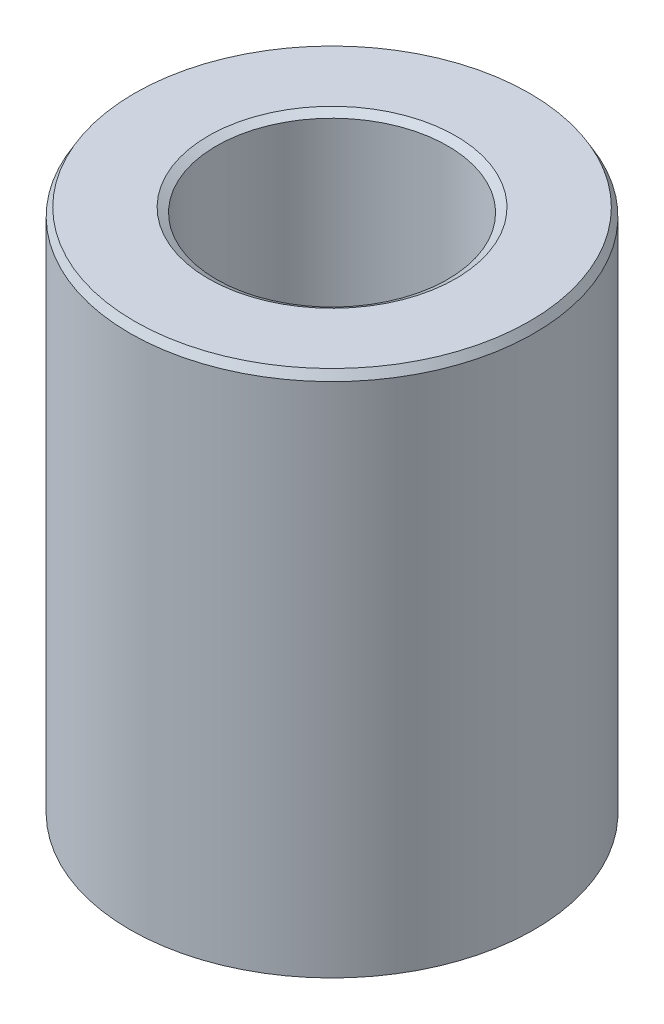
ISO-10303-21;
HEADER;
FILE_DESCRIPTION(('STEP AP214'),'2;1');
FILE_NAME('part.step','',(''),(''),'','','');
FILE_SCHEMA(('AUTOMOTIVE_DESIGN { 1 0 10303 214 1 1 1 1 }'));
ENDSEC;
DATA;
#1=APPLICATION_CONTEXT('core data for automotive mechanical design processes');
#2=APPLICATION_PROTOCOL_DEFINITION('international standard','automotive_design',2000,#1);
#3=PRODUCT_CONTEXT('',#1,'mechanical');
#4=PRODUCT('Part','Part','',(#3));
#5=PRODUCT_RELATED_PRODUCT_CATEGORY('part','',(#4));
#6=PRODUCT_DEFINITION_FORMATION('','',#4);
#7=PRODUCT_DEFINITION_CONTEXT('part definition',#1,'design');
#8=PRODUCT_DEFINITION('design','',#6,#7);
#9=PRODUCT_DEFINITION_SHAPE('','',#8);
#10=(LENGTH_UNIT() NAMED_UNIT(*) SI_UNIT(.MILLI.,.METRE.));
#11=(NAMED_UNIT(*) PLANE_ANGLE_UNIT() SI_UNIT($,.RADIAN.));
#12=(NAMED_UNIT(*) SI_UNIT($,.STERADIAN.) SOLID_ANGLE_UNIT());
#13=UNCERTAINTY_MEASURE_WITH_UNIT(LENGTH_MEASURE(1.E-05),#10,'distance_accuracy_value','');
#14=(GEOMETRIC_REPRESENTATION_CONTEXT(3) GLOBAL_UNCERTAINTY_ASSIGNED_CONTEXT((#13)) GLOBAL_UNIT_ASSIGNED_CONTEXT((#10,
#11,#12)) REPRESENTATION_CONTEXT('',''));
#15=CARTESIAN_POINT('',(0.,0.,0.));
#16=DIRECTION('',(0.,0.,1.));
#17=DIRECTION('',(1.,0.,0.));
#18=AXIS2_PLACEMENT_3D('',#15,#16,#17);
#19=CARTESIAN_POINT('',(0.,91.614825625066,0.));
#20=DIRECTION('',(0.,-1.,0.));
#21=DIRECTION('',(0.,0.,-1.));
#22=AXIS2_PLACEMENT_3D('',#19,#20,#21);
#23=CYLINDRICAL_SURFACE('',#22,35.);
#24=CARTESIAN_POINT('',(0.,0.805560483564102,0.));
#25=DIRECTION('',(0.,1.,0.));
#26=DIRECTION('',(0.,0.,1.));
#27=AXIS2_PLACEMENT_3D('',#24,#25,#26);
#28=CIRCLE('',#27,35.);
#29=CARTESIAN_POINT('',(0.,0.805560483564102,35.));
#30=VERTEX_POINT('',#29);
#31=EDGE_CURVE('E10',#30,#30,#28,.T.);
#32=ORIENTED_EDGE('',*,*,#31,.T.);
#33=EDGE_LOOP('',(#32));
#34=FACE_BOUND('',#33,.T.);
#35=CARTESIAN_POINT('',(0.,90.2195539389632,0.));
#36=DIRECTION('',(0.,1.,0.));
#37=DIRECTION('',(0.,0.,1.));
#38=AXIS2_PLACEMENT_3D('',#35,#36,#37);
#39=CIRCLE('',#38,35.);
#40=CARTESIAN_POINT('',(0.,90.2195539389632,35.));
#41=VERTEX_POINT('',#40);
#42=EDGE_CURVE('E50',#41,#41,#39,.F.);
#43=ORIENTED_EDGE('',*,*,#42,.T.);
#44=EDGE_LOOP('',(#43));
#45=FACE_BOUND('',#44,.T.);
#46=ADVANCED_FACE('F39',(#34,#45),#23,.T.);
#47=CARTESIAN_POINT('',(0.,91.614825625066,0.));
#48=DIRECTION('',(0.,1.,0.));
#49=DIRECTION('',(0.,0.,1.));
#50=AXIS2_PLACEMENT_3D('',#47,#48,#49);
#51=PLANE('',#50);
#52=CARTESIAN_POINT('',(0.,91.614825625066,0.));
#53=DIRECTION('',(0.,1.,0.));
#54=DIRECTION('',(0.,0.,1.));
#55=AXIS2_PLACEMENT_3D('',#52,#53,#54);
#56=CIRCLE('',#55,21.4186593110688);
#57=CARTESIAN_POINT('',(0.,91.614825625066,21.4186593110688));
#58=VERTEX_POINT('',#57);
#59=EDGE_CURVE('E58',#58,#58,#56,.F.);
#60=ORIENTED_EDGE('',*,*,#59,.T.);
#61=EDGE_LOOP('',(#60));
#62=FACE_BOUND('',#61,.T.);
#63=CARTESIAN_POINT('',(0.,91.614825625066,0.));
#64=DIRECTION('',(0.,1.,0.));
#65=DIRECTION('',(0.,0.,1.));
#66=AXIS2_PLACEMENT_3D('',#63,#64,#65);
#67=CIRCLE('',#66,34.1944395164359);
#68=CARTESIAN_POINT('',(0.,91.614825625066,34.1944395164359));
#69=VERTEX_POINT('',#68);
#70=EDGE_CURVE('E61',#69,#69,#67,.T.);
#71=ORIENTED_EDGE('',*,*,#70,.T.);
#72=EDGE_LOOP('',(#71));
#73=FACE_BOUND('',#72,.T.);
#74=ADVANCED_FACE('F88',(#62,#73),#51,.T.);
#75=CARTESIAN_POINT('',(0.,0.,0.));
#76=DIRECTION('',(0.,1.,0.));
#77=DIRECTION('',(0.,0.,1.));
#78=AXIS2_PLACEMENT_3D('',#75,#76,#77);
#79=PLANE('',#78);
#80=CARTESIAN_POINT('',(0.,0.,0.));
#81=DIRECTION('',(0.,1.,0.));
#82=DIRECTION('',(0.,0.,1.));
#83=AXIS2_PLACEMENT_3D('',#80,#81,#82);
#84=CIRCLE('',#83,20.8289481085301);
#85=CARTESIAN_POINT('',(0.,0.,20.8289481085301));
#86=VERTEX_POINT('',#85);
#87=EDGE_CURVE('E51',#86,#86,#84,.T.);
#88=ORIENTED_EDGE('',*,*,#87,.T.);
#89=EDGE_LOOP('',(#88));
#90=FACE_BOUND('',#89,.T.);
#91=CARTESIAN_POINT('',(0.,0.,0.));
#92=DIRECTION('',(0.,1.,0.));
#93=DIRECTION('',(0.,0.,1.));
#94=AXIS2_PLACEMENT_3D('',#91,#92,#93);
#95=CIRCLE('',#94,33.6047283138972);
#96=CARTESIAN_POINT('',(0.,0.,33.6047283138972));
#97=VERTEX_POINT('',#96);
#98=EDGE_CURVE('E54',#97,#97,#95,.F.);
#99=ORIENTED_EDGE('',*,*,#98,.T.);
#100=EDGE_LOOP('',(#99));
#101=FACE_BOUND('',#100,.T.);
#102=ADVANCED_FACE('F83',(#90,#101),#79,.F.);
#103=CARTESIAN_POINT('',(0.,91.614825625066,0.));
#104=DIRECTION('',(0.,-1.,0.));
#105=DIRECTION('',(0.,0.,-1.));
#106=AXIS2_PLACEMENT_3D('',#103,#104,#105);
#107=CYLINDRICAL_SURFACE('',#106,20.023387624966);
#108=CARTESIAN_POINT('',(0.,90.8092651415019,0.));
#109=DIRECTION('',(0.,1.,0.));
#110=DIRECTION('',(0.,0.,1.));
#111=AXIS2_PLACEMENT_3D('',#108,#109,#110);
#112=CIRCLE('',#111,20.023387624966);
#113=CARTESIAN_POINT('',(0.,90.8092651415019,20.023387624966));
#114=VERTEX_POINT('',#113);
#115=EDGE_CURVE('E67',#114,#114,#112,.T.);
#116=ORIENTED_EDGE('',*,*,#115,.T.);
#117=EDGE_LOOP('',(#116));
#118=FACE_BOUND('',#117,.T.);
#119=CARTESIAN_POINT('',(0.,1.39527168610276,0.));
#120=DIRECTION('',(0.,1.,0.));
#121=DIRECTION('',(0.,0.,1.));
#122=AXIS2_PLACEMENT_3D('',#119,#120,#121);
#123=CIRCLE('',#122,20.023387624966);
#124=CARTESIAN_POINT('',(0.,1.39527168610276,20.023387624966));
#125=VERTEX_POINT('',#124);
#126=EDGE_CURVE('E69',#125,#125,#123,.F.);
#127=ORIENTED_EDGE('',*,*,#126,.T.);
#128=EDGE_LOOP('',(#127));
#129=FACE_BOUND('',#128,.T.);
#130=ADVANCED_FACE('F71',(#118,#129),#107,.F.);
#131=CARTESIAN_POINT('',(0.,90.8092651415019,0.));
#132=DIRECTION('',(0.,1.,0.));
#133=DIRECTION('',(0.,0.,1.));
#134=AXIS2_PLACEMENT_3D('',#131,#132,#133);
#135=CONICAL_SURFACE('',#134,20.023387624966,1.0471975511966);
#136=CARTESIAN_POINT('',(0.,91.614825625066,21.4186593110688));
#137=CARTESIAN_POINT('',(0.,91.6064343700289,21.4041252310052));
#138=CARTESIAN_POINT('',(0.,91.5980431149917,21.3895911509416));
#139=CARTESIAN_POINT('',(0.,91.5812606049175,21.3605229908145));
#140=CARTESIAN_POINT('',(0.,91.5728693498803,21.3459889107509));
#141=CARTESIAN_POINT('',(0.,91.5560868398061,21.3169207506238));
#142=CARTESIAN_POINT('',(0.,91.547695584769,21.3023866705602));
#143=CARTESIAN_POINT('',(0.,91.5309130746947,21.2733185104331));
#144=CARTESIAN_POINT('',(0.,91.5225218196576,21.2587844303695));
#145=CARTESIAN_POINT('',(0.,91.5057393095833,21.2297162702423));
#146=CARTESIAN_POINT('',(0.,91.4973480545462,21.2151821901788));
#147=CARTESIAN_POINT('',(0.,91.480565544472,21.1861140300516));
#148=CARTESIAN_POINT('',(0.,91.4721742894348,21.1715799499881));
#149=CARTESIAN_POINT('',(0.,91.4553917793606,21.1425117898609));
#150=CARTESIAN_POINT('',(0.,91.4470005243235,21.1279777097973));
#151=CARTESIAN_POINT('',(0.,91.4302180142492,21.0989095496702));
#152=CARTESIAN_POINT('',(0.,91.4218267592121,21.0843754696066));
#153=CARTESIAN_POINT('',(0.,91.4050442491378,21.0553073094795));
#154=CARTESIAN_POINT('',(0.,91.3966529941007,21.0407732294159));
#155=CARTESIAN_POINT('',(0.,91.3798704840264,21.0117050692888));
#156=CARTESIAN_POINT('',(0.,91.3714792289893,20.9971709892252));
#157=CARTESIAN_POINT('',(0.,91.3546967189151,20.9681028290981));
#158=CARTESIAN_POINT('',(0.,91.3463054638779,20.9535687490345));
#159=CARTESIAN_POINT('',(0.,91.3295229538037,20.9245005889074));
#160=CARTESIAN_POINT('',(0.,91.3211316987666,20.9099665088438));
#161=CARTESIAN_POINT('',(0.,91.3043491886923,20.8808983487166));
#162=CARTESIAN_POINT('',(0.,91.2959579336552,20.8663642686531));
#163=CARTESIAN_POINT('',(0.,91.2791754235809,20.8372961085259));
#164=CARTESIAN_POINT('',(0.,91.2707841685438,20.8227620284624));
#165=CARTESIAN_POINT('',(0.,91.2540016584696,20.7936938683352));
#166=CARTESIAN_POINT('',(0.,91.2456104034324,20.7791597882717));
#167=CARTESIAN_POINT('',(0.,91.2288278933582,20.7500916281445));
#168=CARTESIAN_POINT('',(0.,91.220436638321,20.7355575480809));
#169=CARTESIAN_POINT('',(0.,91.2036541282468,20.7064893879538));
#170=CARTESIAN_POINT('',(0.,91.1952628732097,20.6919553078902));
#171=CARTESIAN_POINT('',(0.,91.1784803631354,20.6628871477631));
#172=CARTESIAN_POINT('',(0.,91.1700891080983,20.6483530676995));
#173=CARTESIAN_POINT('',(0.,91.153306598024,20.6192849075724));
#174=CARTESIAN_POINT('',(0.,91.1449153429869,20.6047508275088));
#175=CARTESIAN_POINT('',(0.,91.1281328329127,20.5756826673817));
#176=CARTESIAN_POINT('',(0.,91.1197415778755,20.5611485873181));
#177=CARTESIAN_POINT('',(0.,91.1029590678013,20.532080427191));
#178=CARTESIAN_POINT('',(0.,91.0945678127642,20.5175463471274));
#179=CARTESIAN_POINT('',(0.,91.0777853026899,20.4884781870002));
#180=CARTESIAN_POINT('',(0.,91.0693940476528,20.4739441069367));
#181=CARTESIAN_POINT('',(0.,91.0526115375785,20.4448759468095));
#182=CARTESIAN_POINT('',(0.,91.0442202825414,20.430341866746));
#183=CARTESIAN_POINT('',(0.,91.0274377724672,20.4012737066188));
#184=CARTESIAN_POINT('',(0.,91.01904651743,20.3867396265552));
#185=CARTESIAN_POINT('',(0.,91.0022640073558,20.3576714664281));
#186=CARTESIAN_POINT('',(0.,90.9938727523186,20.3431373863645));
#187=CARTESIAN_POINT('',(0.,90.9770902422444,20.3140692262374));
#188=CARTESIAN_POINT('',(0.,90.9686989872073,20.2995351461738));
#189=CARTESIAN_POINT('',(0.,90.951916477133,20.2704669860467));
#190=CARTESIAN_POINT('',(0.,90.9435252220959,20.2559329059831));
#191=CARTESIAN_POINT('',(0.,90.9267427120216,20.226864745856));
#192=CARTESIAN_POINT('',(0.,90.9183514569845,20.2123306657924));
#193=CARTESIAN_POINT('',(0.,90.9015689469103,20.1832625056653));
#194=CARTESIAN_POINT('',(0.,90.8931776918731,20.1687284256017));
#195=CARTESIAN_POINT('',(0.,90.8763951817989,20.1396602654745));
#196=CARTESIAN_POINT('',(0.,90.8680039267618,20.125126185411));
#197=CARTESIAN_POINT('',(0.,90.8512214166875,20.0960580252838));
#198=CARTESIAN_POINT('',(0.,90.8428301616504,20.0815239452203));
#199=CARTESIAN_POINT('',(0.,90.8260476515761,20.0524557850931));
#200=CARTESIAN_POINT('',(0.,90.817656396539,20.0379217050296));
#201=CARTESIAN_POINT('',(0.,90.8092651415019,20.023387624966));
#202=B_SPLINE_CURVE_WITH_KNOTS('',3,(#136,#137,#138,#139,#140,#141,#142,#143,#144,#145,#146,
#147,#148,#149,#150,#151,#152,#153,#154,#155,#156,#157,#158,#159,#160,#161,#162,#163,#164,#165,
#166,#167,#168,#169,#170,#171,#172,#173,#174,#175,#176,#177,#178,#179,#180,#181,#182,#183,#184,
#185,#186,#187,#188,#189,#190,#191,#192,#193,#194,#195,#196,#197,#198,#199,#200,#201),
.UNSPECIFIED.,.F.,.F.,(4,2,2,2,2,2,2,2,2,2,2,2,2,2,2,2,2,2,2,2,2,2,2,2,2,2,2,2,2,2,2,2,4),(0.,
0.0503475302227531,0.10069506044551,0.151042590668267,0.201390120891024,0.251737651113784,
0.302085181336541,0.352432711559291,0.402780241782048,0.453127772004805,0.503475302227565,
0.553822832450322,0.604170362673079,0.654517892895829,0.704865423118589,0.755212953341346,
0.805560483564103,0.85590801378686,0.906255544009617,0.956603074232377,1.00695060445513,
1.05729813467788,1.10764566490064,1.1579931951234,1.20834072534616,1.25868825556892,
1.30903578579167,1.35938331601442,1.40973084623718,1.46007837645994,1.5104259066827,
1.56077343690545,1.6111209671282),.UNSPECIFIED.);
#203=EDGE_CURVE('BSEAM77',#58,#114,#202,.T.);
#204=ORIENTED_EDGE('',*,*,#59,.F.);
#205=ORIENTED_EDGE('',*,*,#115,.F.);
#206=ORIENTED_EDGE('',*,*,#203,.T.);
#207=ORIENTED_EDGE('',*,*,#203,.F.);
#208=EDGE_LOOP('',(#204,#206,#205,#207));
#209=FACE_BOUND('',#208,.T.);
#210=ADVANCED_FACE('F77',(#209),#135,.F.);
#211=CARTESIAN_POINT('',(0.,0.,0.));
#212=DIRECTION('',(0.,-1.,0.));
#213=DIRECTION('',(0.,0.,-1.));
#214=AXIS2_PLACEMENT_3D('',#211,#212,#213);
#215=CONICAL_SURFACE('',#214,20.8289481085301,0.523598775598291);
#216=ORIENTED_EDGE('',*,*,#126,.F.);
#217=EDGE_LOOP('',(#216));
#218=FACE_BOUND('',#217,.T.);
#219=ORIENTED_EDGE('',*,*,#87,.F.);
#220=EDGE_LOOP('',(#219));
#221=FACE_BOUND('',#220,.T.);
#222=ADVANCED_FACE('F73',(#218,#221),#215,.F.);
#223=CARTESIAN_POINT('',(0.,0.805560483564102,0.));
#224=DIRECTION('',(0.,1.,0.));
#225=DIRECTION('',(0.,0.,1.));
#226=AXIS2_PLACEMENT_3D('',#223,#224,#225);
#227=CONICAL_SURFACE('',#226,35.,1.04719755119659);
#228=CARTESIAN_POINT('',(0.,0.,33.6047283138972));
#229=CARTESIAN_POINT('',(0.,0.00839125503712596,33.6192623939608));
#230=CARTESIAN_POINT('',(0.,0.016782510074252,33.6337964740244));
#231=CARTESIAN_POINT('',(0.,0.0335650201485041,33.6628646341515));
#232=CARTESIAN_POINT('',(0.,0.0419562751856302,33.6773987142151));
#233=CARTESIAN_POINT('',(0.,0.0587387852598823,33.7064668743422));
#234=CARTESIAN_POINT('',(0.,0.0671300402970084,33.7210009544058));
#235=CARTESIAN_POINT('',(0.,0.0839125503712606,33.7500691145329));
#236=CARTESIAN_POINT('',(0.,0.0923038054083866,33.7646031945965));
#237=CARTESIAN_POINT('',(0.,0.109086315482639,33.7936713547237));
#238=CARTESIAN_POINT('',(0.,0.117477570519765,33.8082054347872));
#239=CARTESIAN_POINT('',(0.,0.134260080594017,33.8372735949144));
#240=CARTESIAN_POINT('',(0.,0.142651335631143,33.8518076749779));
#241=CARTESIAN_POINT('',(0.,0.159433845705395,33.8808758351051));
#242=CARTESIAN_POINT('',(0.,0.167825100742521,33.8954099151686));
#243=CARTESIAN_POINT('',(0.,0.184607610816773,33.9244780752958));
#244=CARTESIAN_POINT('',(0.,0.192998865853899,33.9390121553594));
#245=CARTESIAN_POINT('',(0.,0.209781375928152,33.9680803154865));
#246=CARTESIAN_POINT('',(0.,0.218172630965278,33.9826143955501));
#247=CARTESIAN_POINT('',(0.,0.23495514103953,34.0116825556772));
#248=CARTESIAN_POINT('',(0.,0.243346396076656,34.0262166357408));
#249=CARTESIAN_POINT('',(0.,0.260128906150908,34.0552847958679));
#250=CARTESIAN_POINT('',(0.,0.268520161188034,34.0698188759315));
#251=CARTESIAN_POINT('',(0.,0.285302671262286,34.0988870360586));
#252=CARTESIAN_POINT('',(0.,0.293693926299412,34.1134211161222));
#253=CARTESIAN_POINT('',(0.,0.310476436373664,34.1424892762493));
#254=CARTESIAN_POINT('',(0.,0.31886769141079,34.1570233563129));
#255=CARTESIAN_POINT('',(0.,0.335650201485043,34.1860915164401));
#256=CARTESIAN_POINT('',(0.,0.344041456522169,34.2006255965036));
#257=CARTESIAN_POINT('',(0.,0.360823966596421,34.2296937566308));
#258=CARTESIAN_POINT('',(0.,0.369215221633547,34.2442278366943));
#259=CARTESIAN_POINT('',(0.,0.385997731707799,34.2732959968215));
#260=CARTESIAN_POINT('',(0.,0.394388986744926,34.2878300768851));
#261=CARTESIAN_POINT('',(0.,0.411171496819177,34.3168982370122));
#262=CARTESIAN_POINT('',(0.,0.419562751856303,34.3314323170758));
#263=CARTESIAN_POINT('',(0.,0.436345261930555,34.3605004772029));
#264=CARTESIAN_POINT('',(0.,0.444736516967681,34.3750345572665));
#265=CARTESIAN_POINT('',(0.,0.461519027041934,34.4041027173936));
#266=CARTESIAN_POINT('',(0.,0.46991028207906,34.4186367974572));
#267=CARTESIAN_POINT('',(0.,0.486692792153312,34.4477049575843));
#268=CARTESIAN_POINT('',(0.,0.495084047190438,34.4622390376479));
#269=CARTESIAN_POINT('',(0.,0.51186655726469,34.491307197775));
#270=CARTESIAN_POINT('',(0.,0.520257812301816,34.5058412778386));
#271=CARTESIAN_POINT('',(0.,0.537040322376068,34.5349094379658));
#272=CARTESIAN_POINT('',(0.,0.545431577413194,34.5494435180293));
#273=CARTESIAN_POINT('',(0.,0.562214087487446,34.5785116781565));
#274=CARTESIAN_POINT('',(0.,0.570605342524572,34.59304575822));
#275=CARTESIAN_POINT('',(0.,0.587387852598824,34.6221139183472));
#276=CARTESIAN_POINT('',(0.,0.595779107635951,34.6366479984108));
#277=CARTESIAN_POINT('',(0.,0.612561617710203,34.6657161585379));
#278=CARTESIAN_POINT('',(0.,0.620952872747329,34.6802502386015));
#279=CARTESIAN_POINT('',(0.,0.637735382821581,34.7093183987286));
#280=CARTESIAN_POINT('',(0.,0.646126637858707,34.7238524787922));
#281=CARTESIAN_POINT('',(0.,0.662909147932959,34.7529206389193));
#282=CARTESIAN_POINT('',(0.,0.671300402970085,34.7674547189829));
#283=CARTESIAN_POINT('',(0.,0.688082913044337,34.79652287911));
#284=CARTESIAN_POINT('',(0.,0.696474168081463,34.8110569591736));
#285=CARTESIAN_POINT('',(0.,0.713256678155715,34.8401251193007));
#286=CARTESIAN_POINT('',(0.,0.721647933192842,34.8546591993643));
#287=CARTESIAN_POINT('',(0.,0.738430443267094,34.8837273594914));
#288=CARTESIAN_POINT('',(0.,0.74682169830422,34.898261439555));
#289=CARTESIAN_POINT('',(0.,0.763604208378472,34.9273295996822));
#290=CARTESIAN_POINT('',(0.,0.771995463415598,34.9418636797457));
#291=CARTESIAN_POINT('',(0.,0.78877797348985,34.9709318398729));
#292=CARTESIAN_POINT('',(0.,0.797169228526976,34.9854659199364));
#293=CARTESIAN_POINT('',(0.,0.805560483564102,35.));
#294=B_SPLINE_CURVE_WITH_KNOTS('',3,(#228,#229,#230,#231,#232,#233,#234,#235,#236,#237,#238,
#239,#240,#241,#242,#243,#244,#245,#246,#247,#248,#249,#250,#251,#252,#253,#254,#255,#256,#257,
#258,#259,#260,#261,#262,#263,#264,#265,#266,#267,#268,#269,#270,#271,#272,#273,#274,#275,#276,
#277,#278,#279,#280,#281,#282,#283,#284,#285,#286,#287,#288,#289,#290,#291,#292,#293),
.UNSPECIFIED.,.F.,.F.,(4,2,2,2,2,2,2,2,2,2,2,2,2,2,2,2,2,2,2,2,2,2,2,2,2,2,2,2,2,2,2,2,4),(0.,
0.0503475302227559,0.100695060445512,0.151042590668268,0.201390120891024,0.25173765111378,
0.302085181336536,0.352432711559291,0.402780241782047,0.453127772004803,0.503475302227559,
0.553822832450315,0.604170362673071,0.654517892895827,0.704865423118583,0.755212953341339,
0.805560483564095,0.855908013786857,0.906255544009613,0.956603074232369,1.00695060445512,
1.05729813467788,1.10764566490064,1.15799319512339,1.20834072534615,1.2586882555689,
1.30903578579166,1.35938331601442,1.40973084623717,1.46007837645993,1.51042590668268,
1.56077343690544,1.6111209671282),.UNSPECIFIED.);
#295=EDGE_CURVE('BSEAM76',#97,#30,#294,.T.);
#296=ORIENTED_EDGE('',*,*,#98,.F.);
#297=ORIENTED_EDGE('',*,*,#31,.F.);
#298=ORIENTED_EDGE('',*,*,#295,.T.);
#299=ORIENTED_EDGE('',*,*,#295,.F.);
#300=EDGE_LOOP('',(#296,#298,#297,#299));
#301=FACE_BOUND('',#300,.T.);
#302=ADVANCED_FACE('F76',(#301),#227,.T.);
#303=CARTESIAN_POINT('',(0.,91.614825625066,0.));
#304=DIRECTION('',(0.,-1.,0.));
#305=DIRECTION('',(0.,0.,-1.));
#306=AXIS2_PLACEMENT_3D('',#303,#304,#305);
#307=CONICAL_SURFACE('',#306,34.1944395164359,0.523598775598297);
#308=ORIENTED_EDGE('',*,*,#42,.F.);
#309=EDGE_LOOP('',(#308));
#310=FACE_BOUND('',#309,.T.);
#311=ORIENTED_EDGE('',*,*,#70,.F.);
#312=EDGE_LOOP('',(#311));
#313=FACE_BOUND('',#312,.T.);
#314=ADVANCED_FACE('F45',(#310,#313),#307,.T.);
#315=CLOSED_SHELL('',(#46,#74,#102,#130,#210,#222,#302,#314));
#316=MANIFOLD_SOLID_BREP('B2',#315);
#317=ADVANCED_BREP_SHAPE_REPRESENTATION('',(#18,#316),#14);
#318=SHAPE_DEFINITION_REPRESENTATION(#9,#317);
ENDSEC;
END-ISO-10303-21;
